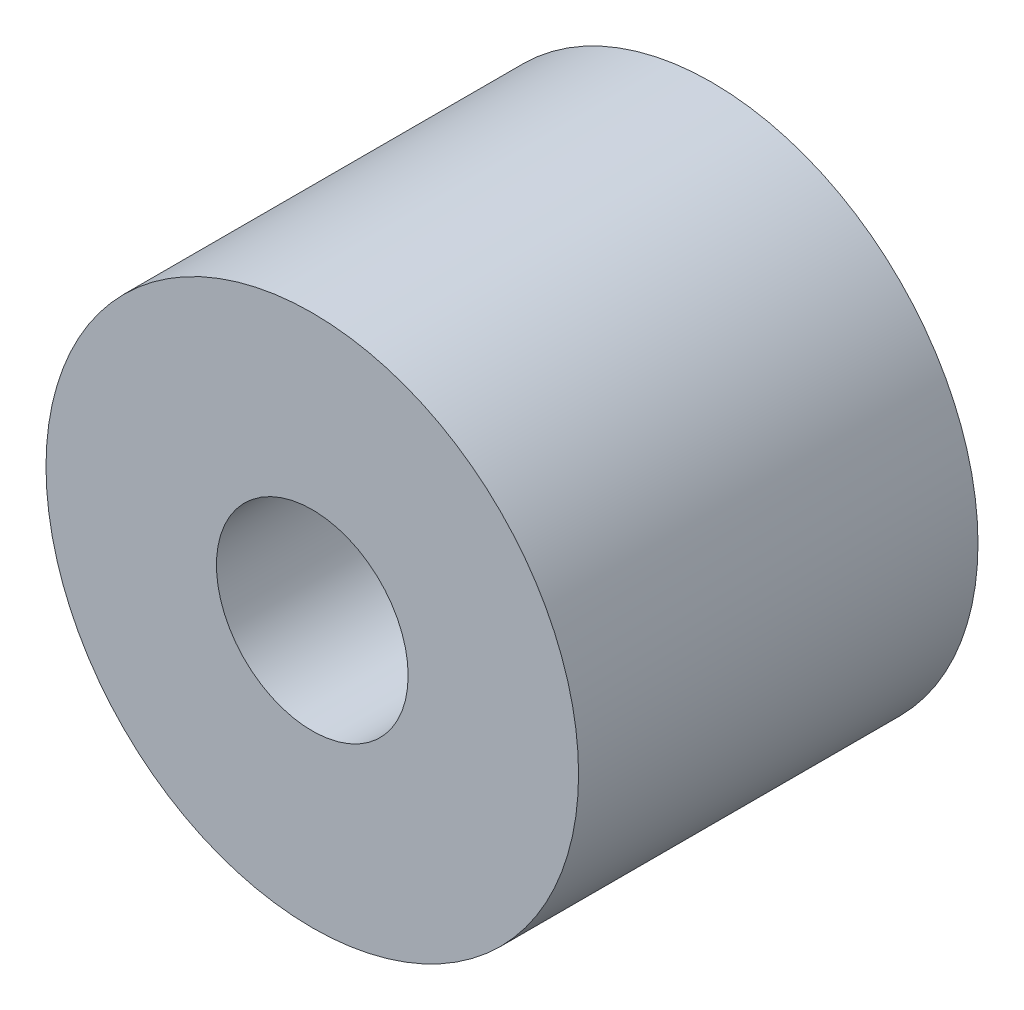
ISO-10303-21;
HEADER;
FILE_DESCRIPTION(('STEP AP214'),'2;1');
FILE_NAME('part.step','',(''),(''),'','','');
FILE_SCHEMA(('AUTOMOTIVE_DESIGN { 1 0 10303 214 1 1 1 1 }'));
ENDSEC;
DATA;
#1=APPLICATION_CONTEXT('core data for automotive mechanical design processes');
#2=APPLICATION_PROTOCOL_DEFINITION('international standard','automotive_design',2000,#1);
#3=PRODUCT_CONTEXT('',#1,'mechanical');
#4=PRODUCT('Part','Part','',(#3));
#5=PRODUCT_RELATED_PRODUCT_CATEGORY('part','',(#4));
#6=PRODUCT_DEFINITION_FORMATION('','',#4);
#7=PRODUCT_DEFINITION_CONTEXT('part definition',#1,'design');
#8=PRODUCT_DEFINITION('design','',#6,#7);
#9=PRODUCT_DEFINITION_SHAPE('','',#8);
#10=(LENGTH_UNIT() NAMED_UNIT(*) SI_UNIT(.MILLI.,.METRE.));
#11=(NAMED_UNIT(*) PLANE_ANGLE_UNIT() SI_UNIT($,.RADIAN.));
#12=(NAMED_UNIT(*) SI_UNIT($,.STERADIAN.) SOLID_ANGLE_UNIT());
#13=UNCERTAINTY_MEASURE_WITH_UNIT(LENGTH_MEASURE(1.E-05),#10,'distance_accuracy_value','');
#14=(GEOMETRIC_REPRESENTATION_CONTEXT(3) GLOBAL_UNCERTAINTY_ASSIGNED_CONTEXT((#13)) GLOBAL_UNIT_ASSIGNED_CONTEXT((#10,
#11,#12)) REPRESENTATION_CONTEXT('',''));
#15=CARTESIAN_POINT('',(0.,0.,0.));
#16=DIRECTION('',(0.,0.,1.));
#17=DIRECTION('',(1.,0.,0.));
#18=AXIS2_PLACEMENT_3D('',#15,#16,#17);
#19=CARTESIAN_POINT('',(0.,0.,2.38125));
#20=DIRECTION('',(0.,0.,1.));
#21=DIRECTION('',(1.,0.,0.));
#22=AXIS2_PLACEMENT_3D('',#19,#20,#21);
#23=PLANE('',#22);
#24=CARTESIAN_POINT('',(0.,0.,2.38125));
#25=DIRECTION('',(0.,0.,1.));
#26=DIRECTION('',(1.,0.,0.));
#27=AXIS2_PLACEMENT_3D('',#24,#25,#26);
#28=CIRCLE('',#27,3.175);
#29=CARTESIAN_POINT('',(3.175,0.,2.38125));
#30=VERTEX_POINT('',#29);
#31=EDGE_CURVE('E10',#30,#30,#28,.T.);
#32=ORIENTED_EDGE('',*,*,#31,.T.);
#33=EDGE_LOOP('',(#32));
#34=FACE_BOUND('',#33,.T.);
#35=CARTESIAN_POINT('',(0.,0.,2.38125));
#36=DIRECTION('',(0.,0.,1.));
#37=DIRECTION('',(1.,0.,0.));
#38=AXIS2_PLACEMENT_3D('',#35,#36,#37);
#39=CIRCLE('',#38,1.143);
#40=CARTESIAN_POINT('',(1.143,0.,2.38125));
#41=VERTEX_POINT('',#40);
#42=EDGE_CURVE('E37',#41,#41,#39,.T.);
#43=ORIENTED_EDGE('',*,*,#42,.F.);
#44=EDGE_LOOP('',(#43));
#45=FACE_BOUND('',#44,.T.);
#46=ADVANCED_FACE('F30',(#34,#45),#23,.T.);
#47=CARTESIAN_POINT('',(0.,0.,2.38125));
#48=DIRECTION('',(0.,0.,-1.));
#49=DIRECTION('',(-1.,0.,0.));
#50=AXIS2_PLACEMENT_3D('',#47,#48,#49);
#51=CYLINDRICAL_SURFACE('',#50,3.175);
#52=ORIENTED_EDGE('',*,*,#31,.F.);
#53=EDGE_LOOP('',(#52));
#54=FACE_BOUND('',#53,.T.);
#55=CARTESIAN_POINT('',(0.,0.,-2.38125));
#56=DIRECTION('',(0.,0.,1.));
#57=DIRECTION('',(1.,0.,0.));
#58=AXIS2_PLACEMENT_3D('',#55,#56,#57);
#59=CIRCLE('',#58,3.175);
#60=CARTESIAN_POINT('',(3.175,0.,-2.38125));
#61=VERTEX_POINT('',#60);
#62=EDGE_CURVE('E41',#61,#61,#59,.T.);
#63=ORIENTED_EDGE('',*,*,#62,.T.);
#64=EDGE_LOOP('',(#63));
#65=FACE_BOUND('',#64,.T.);
#66=ADVANCED_FACE('F32',(#54,#65),#51,.T.);
#67=CARTESIAN_POINT('',(0.,0.,2.38125));
#68=DIRECTION('',(0.,0.,-1.));
#69=DIRECTION('',(-1.,0.,0.));
#70=AXIS2_PLACEMENT_3D('',#67,#68,#69);
#71=CYLINDRICAL_SURFACE('',#70,1.143);
#72=ORIENTED_EDGE('',*,*,#42,.T.);
#73=EDGE_LOOP('',(#72));
#74=FACE_BOUND('',#73,.T.);
#75=CARTESIAN_POINT('',(0.,0.,-2.38125));
#76=DIRECTION('',(0.,0.,1.));
#77=DIRECTION('',(1.,0.,0.));
#78=AXIS2_PLACEMENT_3D('',#75,#76,#77);
#79=CIRCLE('',#78,1.143);
#80=CARTESIAN_POINT('',(1.143,0.,-2.38125));
#81=VERTEX_POINT('',#80);
#82=EDGE_CURVE('E45',#81,#81,#79,.T.);
#83=ORIENTED_EDGE('',*,*,#82,.F.);
#84=EDGE_LOOP('',(#83));
#85=FACE_BOUND('',#84,.T.);
#86=ADVANCED_FACE('F54',(#74,#85),#71,.F.);
#87=CARTESIAN_POINT('',(0.,0.,-2.38125));
#88=DIRECTION('',(0.,0.,1.));
#89=DIRECTION('',(1.,0.,0.));
#90=AXIS2_PLACEMENT_3D('',#87,#88,#89);
#91=PLANE('',#90);
#92=ORIENTED_EDGE('',*,*,#82,.T.);
#93=EDGE_LOOP('',(#92));
#94=FACE_BOUND('',#93,.T.);
#95=ORIENTED_EDGE('',*,*,#62,.F.);
#96=EDGE_LOOP('',(#95));
#97=FACE_BOUND('',#96,.T.);
#98=ADVANCED_FACE('F51',(#94,#97),#91,.F.);
#99=CLOSED_SHELL('',(#46,#66,#86,#98));
#100=MANIFOLD_SOLID_BREP('B2',#99);
#101=ADVANCED_BREP_SHAPE_REPRESENTATION('',(#18,#100),#14);
#102=SHAPE_DEFINITION_REPRESENTATION(#9,#101);
ENDSEC;
END-ISO-10303-21;
